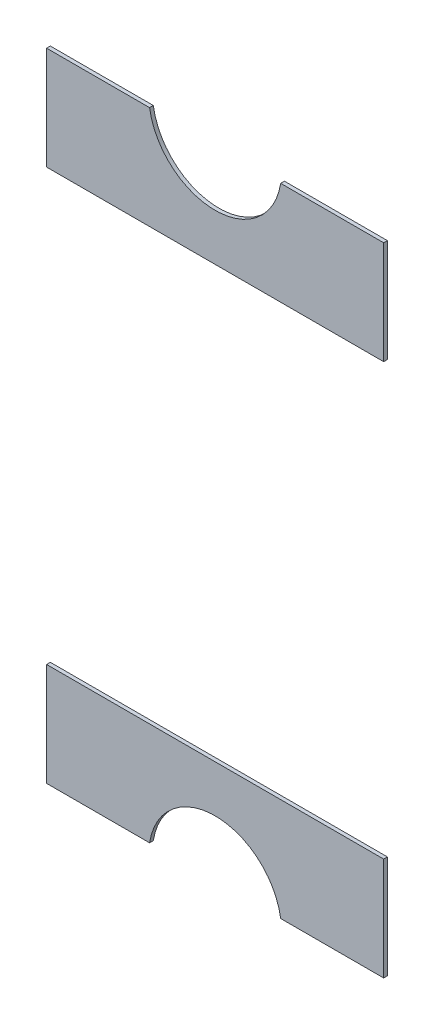
ISO-10303-21;
HEADER;
FILE_DESCRIPTION(('STEP AP214'),'2;1');
FILE_NAME('part.step','',(''),(''),'','','');
FILE_SCHEMA(('AUTOMOTIVE_DESIGN { 1 0 10303 214 1 1 1 1 }'));
ENDSEC;
DATA;
#1=APPLICATION_CONTEXT('core data for automotive mechanical design processes');
#2=APPLICATION_PROTOCOL_DEFINITION('international standard','automotive_design',2000,#1);
#3=PRODUCT_CONTEXT('',#1,'mechanical');
#4=PRODUCT('Part','Part','',(#3));
#5=PRODUCT_RELATED_PRODUCT_CATEGORY('part','',(#4));
#6=PRODUCT_DEFINITION_FORMATION('','',#4);
#7=PRODUCT_DEFINITION_CONTEXT('part definition',#1,'design');
#8=PRODUCT_DEFINITION('design','',#6,#7);
#9=PRODUCT_DEFINITION_SHAPE('','',#8);
#10=(LENGTH_UNIT() NAMED_UNIT(*) SI_UNIT(.MILLI.,.METRE.));
#11=(NAMED_UNIT(*) PLANE_ANGLE_UNIT() SI_UNIT($,.RADIAN.));
#12=(NAMED_UNIT(*) SI_UNIT($,.STERADIAN.) SOLID_ANGLE_UNIT());
#13=UNCERTAINTY_MEASURE_WITH_UNIT(LENGTH_MEASURE(1.E-05),#10,'distance_accuracy_value','');
#14=(GEOMETRIC_REPRESENTATION_CONTEXT(3) GLOBAL_UNCERTAINTY_ASSIGNED_CONTEXT((#13)) GLOBAL_UNIT_ASSIGNED_CONTEXT((#10,
#11,#12)) REPRESENTATION_CONTEXT('',''));
#15=CARTESIAN_POINT('',(0.,0.,0.));
#16=DIRECTION('',(0.,0.,1.));
#17=DIRECTION('',(1.,0.,0.));
#18=AXIS2_PLACEMENT_3D('',#15,#16,#17);
#19=CARTESIAN_POINT('',(-0.45,-0.85,0.309999999776));
#20=DIRECTION('',(0.,0.,1.));
#21=DIRECTION('',(1.,0.,0.));
#22=AXIS2_PLACEMENT_3D('',#19,#20,#21);
#23=PLANE('',#22);
#24=DIRECTION('',(1.,0.,0.));
#25=VECTOR('',#24,1.);
#26=CARTESIAN_POINT('',(0.45,-0.85,0.309999999776));
#27=LINE('',#26,#25);
#28=CARTESIAN_POINT('',(0.45,-0.85,0.309999999776));
#29=VERTEX_POINT('',#28);
#30=CARTESIAN_POINT('',(0.174999999999857,-0.85,0.309999999776));
#31=VERTEX_POINT('',#30);
#32=EDGE_CURVE('P0_E70',#29,#31,#27,.F.);
#33=ORIENTED_EDGE('',*,*,#32,.F.);
#34=DIRECTION('',(0.,1.,0.));
#35=VECTOR('',#34,1.);
#36=CARTESIAN_POINT('',(0.45,-0.575,0.309999999776));
#37=LINE('',#36,#35);
#38=CARTESIAN_POINT('',(0.45,-0.575,0.309999999776));
#39=VERTEX_POINT('',#38);
#40=EDGE_CURVE('P0_E99',#39,#29,#37,.F.);
#41=ORIENTED_EDGE('',*,*,#40,.F.);
#42=DIRECTION('',(1.,0.,0.));
#43=VECTOR('',#42,1.);
#44=CARTESIAN_POINT('',(-0.45,-0.575,0.309999999776));
#45=LINE('',#44,#43);
#46=CARTESIAN_POINT('',(-0.45,-0.575,0.309999999776));
#47=VERTEX_POINT('',#46);
#48=EDGE_CURVE('P0_E111',#47,#39,#45,.T.);
#49=ORIENTED_EDGE('',*,*,#48,.F.);
#50=DIRECTION('',(0.,1.,0.));
#51=VECTOR('',#50,1.);
#52=CARTESIAN_POINT('',(-0.45,-0.85,0.309999999776));
#53=LINE('',#52,#51);
#54=CARTESIAN_POINT('',(-0.45,-0.85,0.309999999776));
#55=VERTEX_POINT('',#54);
#56=EDGE_CURVE('P0_E104',#55,#47,#53,.T.);
#57=ORIENTED_EDGE('',*,*,#56,.F.);
#58=DIRECTION('',(1.,0.,0.));
#59=VECTOR('',#58,1.);
#60=CARTESIAN_POINT('',(-0.175,-0.85,0.309999999776));
#61=LINE('',#60,#59);
#62=CARTESIAN_POINT('',(-0.174999999999718,-0.850000000000022,0.309999999776));
#63=VERTEX_POINT('',#62);
#64=EDGE_CURVE('P0_E73',#63,#55,#61,.F.);
#65=ORIENTED_EDGE('',*,*,#64,.F.);
#66=CARTESIAN_POINT('',(0.,-0.877083333333,0.309999999776));
#67=DIRECTION('',(0.,0.,-1.));
#68=DIRECTION('',(-1.,0.,0.));
#69=AXIS2_PLACEMENT_3D('',#66,#67,#68);
#70=CIRCLE('',#69,0.177083333333);
#71=EDGE_CURVE('P0_E20',#63,#31,#70,.T.);
#72=ORIENTED_EDGE('',*,*,#71,.T.);
#73=EDGE_LOOP('',(#33,#41,#49,#57,#65,#72));
#74=FACE_BOUND('',#73,.T.);
#75=ADVANCED_FACE('P0_F17',(#74),#23,.T.);
#76=CARTESIAN_POINT('',(-0.45,-0.85,0.3));
#77=DIRECTION('',(-1.,0.,0.));
#78=DIRECTION('',(0.,0.,1.));
#79=AXIS2_PLACEMENT_3D('',#76,#77,#78);
#80=PLANE('',#79);
#81=DIRECTION('',(0.,0.,-1.));
#82=VECTOR('',#81,1.);
#83=CARTESIAN_POINT('',(-0.45,-0.85,0.3));
#84=LINE('',#83,#82);
#85=CARTESIAN_POINT('',(-0.45,-0.85,0.3));
#86=VERTEX_POINT('',#85);
#87=EDGE_CURVE('P0_E102',#55,#86,#84,.T.);
#88=ORIENTED_EDGE('',*,*,#87,.F.);
#89=ORIENTED_EDGE('',*,*,#56,.T.);
#90=DIRECTION('',(0.,0.,1.));
#91=VECTOR('',#90,1.);
#92=CARTESIAN_POINT('',(-0.45,-0.575,0.3));
#93=LINE('',#92,#91);
#94=CARTESIAN_POINT('',(-0.45,-0.575,0.3));
#95=VERTEX_POINT('',#94);
#96=EDGE_CURVE('P0_E114',#95,#47,#93,.T.);
#97=ORIENTED_EDGE('',*,*,#96,.F.);
#98=DIRECTION('',(0.,1.,0.));
#99=VECTOR('',#98,1.);
#100=CARTESIAN_POINT('',(-0.45,-0.85,0.3));
#101=LINE('',#100,#99);
#102=EDGE_CURVE('P0_E107',#95,#86,#101,.F.);
#103=ORIENTED_EDGE('',*,*,#102,.T.);
#104=EDGE_LOOP('',(#88,#89,#97,#103));
#105=FACE_BOUND('',#104,.T.);
#106=ADVANCED_FACE('P0_F149',(#105),#80,.T.);
#107=CARTESIAN_POINT('',(-0.175,-0.85,0.3));
#108=DIRECTION('',(0.,-1.,0.));
#109=DIRECTION('',(0.,0.,-1.));
#110=AXIS2_PLACEMENT_3D('',#107,#108,#109);
#111=PLANE('',#110);
#112=DIRECTION('',(0.,0.,-1.));
#113=VECTOR('',#112,1.);
#114=CARTESIAN_POINT('',(-0.174999999999721,-0.850000000000043,0.3));
#115=LINE('',#114,#113);
#116=CARTESIAN_POINT('',(-0.174999999999718,-0.850000000000022,0.3));
#117=VERTEX_POINT('',#116);
#118=EDGE_CURVE('P0_E75',#117,#63,#115,.F.);
#119=ORIENTED_EDGE('',*,*,#118,.T.);
#120=ORIENTED_EDGE('',*,*,#64,.T.);
#121=ORIENTED_EDGE('',*,*,#87,.T.);
#122=DIRECTION('',(1.,0.,0.));
#123=VECTOR('',#122,1.);
#124=CARTESIAN_POINT('',(-0.45,-0.85,0.3));
#125=LINE('',#124,#123);
#126=EDGE_CURVE('P0_E110',#86,#117,#125,.T.);
#127=ORIENTED_EDGE('',*,*,#126,.T.);
#128=EDGE_LOOP('',(#119,#120,#121,#127));
#129=FACE_BOUND('',#128,.T.);
#130=ADVANCED_FACE('P0_F142',(#129),#111,.T.);
#131=CARTESIAN_POINT('',(0.,-0.877083333333,0.3));
#132=DIRECTION('',(0.,0.,-1.));
#133=DIRECTION('',(-1.,0.,0.));
#134=AXIS2_PLACEMENT_3D('',#131,#132,#133);
#135=CYLINDRICAL_SURFACE('',#134,0.177083333333);
#136=CARTESIAN_POINT('',(0.,-0.877083333333,0.3));
#137=DIRECTION('',(0.,0.,-1.));
#138=DIRECTION('',(-1.,0.,0.));
#139=AXIS2_PLACEMENT_3D('',#136,#137,#138);
#140=CIRCLE('',#139,0.177083333333);
#141=CARTESIAN_POINT('',(0.174999999999857,-0.85,0.3));
#142=VERTEX_POINT('',#141);
#143=EDGE_CURVE('P0_E87',#117,#142,#140,.T.);
#144=ORIENTED_EDGE('',*,*,#143,.T.);
#145=DIRECTION('',(0.,0.,-1.));
#146=VECTOR('',#145,1.);
#147=CARTESIAN_POINT('',(0.175,-0.85,0.3));
#148=LINE('',#147,#146);
#149=EDGE_CURVE('P0_E80',#31,#142,#148,.T.);
#150=ORIENTED_EDGE('',*,*,#149,.F.);
#151=ORIENTED_EDGE('',*,*,#71,.F.);
#152=ORIENTED_EDGE('',*,*,#118,.F.);
#153=EDGE_LOOP('',(#144,#150,#151,#152));
#154=FACE_BOUND('',#153,.T.);
#155=ADVANCED_FACE('P0_F85',(#154),#135,.F.);
#156=CARTESIAN_POINT('',(0.45,-0.85,0.3));
#157=DIRECTION('',(0.,-1.,0.));
#158=DIRECTION('',(0.,0.,-1.));
#159=AXIS2_PLACEMENT_3D('',#156,#157,#158);
#160=PLANE('',#159);
#161=DIRECTION('',(0.,0.,-1.));
#162=VECTOR('',#161,1.);
#163=CARTESIAN_POINT('',(0.45,-0.85,0.3));
#164=LINE('',#163,#162);
#165=CARTESIAN_POINT('',(0.45,-0.85,0.3));
#166=VERTEX_POINT('',#165);
#167=EDGE_CURVE('P0_E82',#29,#166,#164,.T.);
#168=ORIENTED_EDGE('',*,*,#167,.F.);
#169=ORIENTED_EDGE('',*,*,#32,.T.);
#170=ORIENTED_EDGE('',*,*,#149,.T.);
#171=DIRECTION('',(1.,0.,0.));
#172=VECTOR('',#171,1.);
#173=CARTESIAN_POINT('',(-0.45,-0.85,0.3));
#174=LINE('',#173,#172);
#175=EDGE_CURVE('P0_E95',#142,#166,#174,.T.);
#176=ORIENTED_EDGE('',*,*,#175,.T.);
#177=EDGE_LOOP('',(#168,#169,#170,#176));
#178=FACE_BOUND('',#177,.T.);
#179=ADVANCED_FACE('P0_F78',(#178),#160,.T.);
#180=CARTESIAN_POINT('',(0.45,-0.575,0.3));
#181=DIRECTION('',(1.,0.,0.));
#182=DIRECTION('',(0.,0.,-1.));
#183=AXIS2_PLACEMENT_3D('',#180,#181,#182);
#184=PLANE('',#183);
#185=DIRECTION('',(0.,0.,1.));
#186=VECTOR('',#185,1.);
#187=CARTESIAN_POINT('',(0.45,-0.575,0.3));
#188=LINE('',#187,#186);
#189=CARTESIAN_POINT('',(0.45,-0.575,0.3));
#190=VERTEX_POINT('',#189);
#191=EDGE_CURVE('P0_E34',#39,#190,#188,.F.);
#192=ORIENTED_EDGE('',*,*,#191,.F.);
#193=ORIENTED_EDGE('',*,*,#40,.T.);
#194=ORIENTED_EDGE('',*,*,#167,.T.);
#195=DIRECTION('',(0.,1.,0.));
#196=VECTOR('',#195,1.);
#197=CARTESIAN_POINT('',(0.45,-0.85,0.3));
#198=LINE('',#197,#196);
#199=EDGE_CURVE('P0_E26',#166,#190,#198,.T.);
#200=ORIENTED_EDGE('',*,*,#199,.T.);
#201=EDGE_LOOP('',(#192,#193,#194,#200));
#202=FACE_BOUND('',#201,.T.);
#203=ADVANCED_FACE('P0_F153',(#202),#184,.T.);
#204=CARTESIAN_POINT('',(-0.45,-0.575,0.3));
#205=DIRECTION('',(0.,1.,0.));
#206=DIRECTION('',(0.,0.,1.));
#207=AXIS2_PLACEMENT_3D('',#204,#205,#206);
#208=PLANE('',#207);
#209=ORIENTED_EDGE('',*,*,#96,.T.);
#210=ORIENTED_EDGE('',*,*,#48,.T.);
#211=ORIENTED_EDGE('',*,*,#191,.T.);
#212=DIRECTION('',(1.,0.,0.));
#213=VECTOR('',#212,1.);
#214=CARTESIAN_POINT('',(-0.45,-0.575,0.3));
#215=LINE('',#214,#213);
#216=EDGE_CURVE('P0_E11',#190,#95,#215,.F.);
#217=ORIENTED_EDGE('',*,*,#216,.T.);
#218=EDGE_LOOP('',(#209,#210,#211,#217));
#219=FACE_BOUND('',#218,.T.);
#220=ADVANCED_FACE('P0_F151',(#219),#208,.T.);
#221=CARTESIAN_POINT('',(-0.45,-0.85,0.3));
#222=DIRECTION('',(0.,0.,1.));
#223=DIRECTION('',(1.,0.,0.));
#224=AXIS2_PLACEMENT_3D('',#221,#222,#223);
#225=PLANE('',#224);
#226=ORIENTED_EDGE('',*,*,#199,.F.);
#227=ORIENTED_EDGE('',*,*,#175,.F.);
#228=ORIENTED_EDGE('',*,*,#143,.F.);
#229=ORIENTED_EDGE('',*,*,#126,.F.);
#230=ORIENTED_EDGE('',*,*,#102,.F.);
#231=ORIENTED_EDGE('',*,*,#216,.F.);
#232=EDGE_LOOP('',(#226,#227,#228,#229,#230,#231));
#233=FACE_BOUND('',#232,.T.);
#234=ADVANCED_FACE('P0_F146',(#233),#225,.F.);
#235=CLOSED_SHELL('',(#75,#106,#130,#155,#179,#203,#220,#234));
#236=MANIFOLD_SOLID_BREP('P0_B1',#235);
#237=CARTESIAN_POINT('',(-0.175,0.85,0.3));
#238=DIRECTION('',(0.,0.,-1.));
#239=DIRECTION('',(-1.,0.,0.));
#240=AXIS2_PLACEMENT_3D('',#237,#238,#239);
#241=PLANE('',#240);
#242=DIRECTION('',(0.,1.,0.));
#243=VECTOR('',#242,1.);
#244=CARTESIAN_POINT('',(0.45,0.575,0.3));
#245=LINE('',#244,#243);
#246=CARTESIAN_POINT('',(0.45,0.85,0.3));
#247=VERTEX_POINT('',#246);
#248=CARTESIAN_POINT('',(0.45,0.575,0.3));
#249=VERTEX_POINT('',#248);
#250=EDGE_CURVE('P1_E88',#247,#249,#245,.F.);
#251=ORIENTED_EDGE('',*,*,#250,.T.);
#252=DIRECTION('',(1.,0.,0.));
#253=VECTOR('',#252,1.);
#254=CARTESIAN_POINT('',(-0.45,0.575,0.3));
#255=LINE('',#254,#253);
#256=CARTESIAN_POINT('',(-0.45,0.575,0.3));
#257=VERTEX_POINT('',#256);
#258=EDGE_CURVE('P1_E102',#249,#257,#255,.F.);
#259=ORIENTED_EDGE('',*,*,#258,.T.);
#260=DIRECTION('',(0.,1.,0.));
#261=VECTOR('',#260,1.);
#262=CARTESIAN_POINT('',(-0.45,0.85,0.3));
#263=LINE('',#262,#261);
#264=CARTESIAN_POINT('',(-0.45,0.85,0.3));
#265=VERTEX_POINT('',#264);
#266=EDGE_CURVE('P1_E109',#257,#265,#263,.T.);
#267=ORIENTED_EDGE('',*,*,#266,.T.);
#268=DIRECTION('',(1.,0.,0.));
#269=VECTOR('',#268,1.);
#270=CARTESIAN_POINT('',(-0.175,0.85,0.3));
#271=LINE('',#270,#269);
#272=CARTESIAN_POINT('',(-0.174999999999718,0.850000000000022,0.3));
#273=VERTEX_POINT('',#272);
#274=EDGE_CURVE('P1_E66',#265,#273,#271,.T.);
#275=ORIENTED_EDGE('',*,*,#274,.T.);
#276=CARTESIAN_POINT('',(0.,0.877083333333,0.3));
#277=DIRECTION('',(0.,0.,-1.));
#278=DIRECTION('',(-1.,0.,0.));
#279=AXIS2_PLACEMENT_3D('',#276,#277,#278);
#280=CIRCLE('',#279,0.177083333333);
#281=CARTESIAN_POINT('',(0.174999999999857,0.85,0.3));
#282=VERTEX_POINT('',#281);
#283=EDGE_CURVE('P1_E20',#273,#282,#280,.F.);
#284=ORIENTED_EDGE('',*,*,#283,.T.);
#285=DIRECTION('',(1.,0.,0.));
#286=VECTOR('',#285,1.);
#287=CARTESIAN_POINT('',(0.45,0.85,0.3));
#288=LINE('',#287,#286);
#289=EDGE_CURVE('P1_E72',#282,#247,#288,.T.);
#290=ORIENTED_EDGE('',*,*,#289,.T.);
#291=EDGE_LOOP('',(#251,#259,#267,#275,#284,#290));
#292=FACE_BOUND('',#291,.T.);
#293=ADVANCED_FACE('P1_F17',(#292),#241,.T.);
#294=CARTESIAN_POINT('',(-0.175,0.85,0.3));
#295=DIRECTION('',(0.,-1.,0.));
#296=DIRECTION('',(0.,0.,-1.));
#297=AXIS2_PLACEMENT_3D('',#294,#295,#296);
#298=PLANE('',#297);
#299=DIRECTION('',(-1.,0.,0.));
#300=VECTOR('',#299,1.);
#301=CARTESIAN_POINT('',(-0.175,0.85,0.309999999776));
#302=LINE('',#301,#300);
#303=CARTESIAN_POINT('',(-0.45,0.85,0.309999999776));
#304=VERTEX_POINT('',#303);
#305=CARTESIAN_POINT('',(-0.174999999999718,0.850000000000022,0.309999999776));
#306=VERTEX_POINT('',#305);
#307=EDGE_CURVE('P1_E126',#304,#306,#302,.F.);
#308=ORIENTED_EDGE('',*,*,#307,.T.);
#309=DIRECTION('',(0.,0.,-1.));
#310=VECTOR('',#309,1.);
#311=CARTESIAN_POINT('',(-0.174999999999721,0.850000000000043,0.3));
#312=LINE('',#311,#310);
#313=EDGE_CURVE('P1_E83',#306,#273,#312,.T.);
#314=ORIENTED_EDGE('',*,*,#313,.T.);
#315=ORIENTED_EDGE('',*,*,#274,.F.);
#316=DIRECTION('',(0.,0.,-1.));
#317=VECTOR('',#316,1.);
#318=CARTESIAN_POINT('',(-0.45,0.85,0.3));
#319=LINE('',#318,#317);
#320=EDGE_CURVE('P1_E106',#265,#304,#319,.F.);
#321=ORIENTED_EDGE('',*,*,#320,.T.);
#322=EDGE_LOOP('',(#308,#314,#315,#321));
#323=FACE_BOUND('',#322,.T.);
#324=ADVANCED_FACE('P1_F153',(#323),#298,.F.);
#325=CARTESIAN_POINT('',(0.,0.877083333333,0.3));
#326=DIRECTION('',(0.,0.,-1.));
#327=DIRECTION('',(-1.,0.,0.));
#328=AXIS2_PLACEMENT_3D('',#325,#326,#327);
#329=CYLINDRICAL_SURFACE('',#328,0.177083333333);
#330=ORIENTED_EDGE('',*,*,#283,.F.);
#331=ORIENTED_EDGE('',*,*,#313,.F.);
#332=CARTESIAN_POINT('',(0.,0.877083333333,0.309999999776));
#333=DIRECTION('',(0.,0.,-1.));
#334=DIRECTION('',(-1.,0.,0.));
#335=AXIS2_PLACEMENT_3D('',#332,#333,#334);
#336=CIRCLE('',#335,0.177083333333);
#337=CARTESIAN_POINT('',(0.174999999999857,0.85,0.309999999776));
#338=VERTEX_POINT('',#337);
#339=EDGE_CURVE('P1_E87',#306,#338,#336,.F.);
#340=ORIENTED_EDGE('',*,*,#339,.T.);
#341=DIRECTION('',(0.,0.,-1.));
#342=VECTOR('',#341,1.);
#343=CARTESIAN_POINT('',(0.175,0.85,0.3));
#344=LINE('',#343,#342);
#345=EDGE_CURVE('P1_E76',#338,#282,#344,.T.);
#346=ORIENTED_EDGE('',*,*,#345,.T.);
#347=EDGE_LOOP('',(#330,#331,#340,#346));
#348=FACE_BOUND('',#347,.T.);
#349=ADVANCED_FACE('P1_F85',(#348),#329,.F.);
#350=CARTESIAN_POINT('',(0.45,0.85,0.3));
#351=DIRECTION('',(0.,-1.,0.));
#352=DIRECTION('',(0.,0.,-1.));
#353=AXIS2_PLACEMENT_3D('',#350,#351,#352);
#354=PLANE('',#353);
#355=DIRECTION('',(-1.,0.,0.));
#356=VECTOR('',#355,1.);
#357=CARTESIAN_POINT('',(-0.175,0.85,0.309999999776));
#358=LINE('',#357,#356);
#359=CARTESIAN_POINT('',(0.45,0.85,0.309999999776));
#360=VERTEX_POINT('',#359);
#361=EDGE_CURVE('P1_E98',#338,#360,#358,.F.);
#362=ORIENTED_EDGE('',*,*,#361,.T.);
#363=DIRECTION('',(0.,0.,1.));
#364=VECTOR('',#363,1.);
#365=CARTESIAN_POINT('',(0.45,0.85,0.3));
#366=LINE('',#365,#364);
#367=EDGE_CURVE('P1_E78',#360,#247,#366,.F.);
#368=ORIENTED_EDGE('',*,*,#367,.T.);
#369=ORIENTED_EDGE('',*,*,#289,.F.);
#370=ORIENTED_EDGE('',*,*,#345,.F.);
#371=EDGE_LOOP('',(#362,#368,#369,#370));
#372=FACE_BOUND('',#371,.T.);
#373=ADVANCED_FACE('P1_F74',(#372),#354,.F.);
#374=CARTESIAN_POINT('',(0.45,0.575,0.3));
#375=DIRECTION('',(-1.,0.,0.));
#376=DIRECTION('',(0.,0.,1.));
#377=AXIS2_PLACEMENT_3D('',#374,#375,#376);
#378=PLANE('',#377);
#379=DIRECTION('',(0.,1.,0.));
#380=VECTOR('',#379,1.);
#381=CARTESIAN_POINT('',(0.45,0.85,0.309999999776));
#382=LINE('',#381,#380);
#383=CARTESIAN_POINT('',(0.45,0.575,0.309999999776));
#384=VERTEX_POINT('',#383);
#385=EDGE_CURVE('P1_E95',#360,#384,#382,.F.);
#386=ORIENTED_EDGE('',*,*,#385,.T.);
#387=DIRECTION('',(0.,0.,1.));
#388=VECTOR('',#387,1.);
#389=CARTESIAN_POINT('',(0.45,0.575,0.3));
#390=LINE('',#389,#388);
#391=EDGE_CURVE('P1_E118',#384,#249,#390,.F.);
#392=ORIENTED_EDGE('',*,*,#391,.T.);
#393=ORIENTED_EDGE('',*,*,#250,.F.);
#394=ORIENTED_EDGE('',*,*,#367,.F.);
#395=EDGE_LOOP('',(#386,#392,#393,#394));
#396=FACE_BOUND('',#395,.T.);
#397=ADVANCED_FACE('P1_F150',(#396),#378,.F.);
#398=CARTESIAN_POINT('',(-0.45,0.575,0.3));
#399=DIRECTION('',(0.,1.,0.));
#400=DIRECTION('',(0.,0.,1.));
#401=AXIS2_PLACEMENT_3D('',#398,#399,#400);
#402=PLANE('',#401);
#403=DIRECTION('',(-1.,0.,0.));
#404=VECTOR('',#403,1.);
#405=CARTESIAN_POINT('',(-0.175,0.575,0.309999999776));
#406=LINE('',#405,#404);
#407=CARTESIAN_POINT('',(-0.45,0.575,0.309999999776));
#408=VERTEX_POINT('',#407);
#409=EDGE_CURVE('P1_E26',#384,#408,#406,.T.);
#410=ORIENTED_EDGE('',*,*,#409,.T.);
#411=DIRECTION('',(0.,0.,-1.));
#412=VECTOR('',#411,1.);
#413=CARTESIAN_POINT('',(-0.45,0.575,0.3));
#414=LINE('',#413,#412);
#415=EDGE_CURVE('P1_E34',#408,#257,#414,.T.);
#416=ORIENTED_EDGE('',*,*,#415,.T.);
#417=ORIENTED_EDGE('',*,*,#258,.F.);
#418=ORIENTED_EDGE('',*,*,#391,.F.);
#419=EDGE_LOOP('',(#410,#416,#417,#418));
#420=FACE_BOUND('',#419,.T.);
#421=ADVANCED_FACE('P1_F145',(#420),#402,.F.);
#422=CARTESIAN_POINT('',(-0.45,0.85,0.3));
#423=DIRECTION('',(1.,0.,0.));
#424=DIRECTION('',(0.,0.,-1.));
#425=AXIS2_PLACEMENT_3D('',#422,#423,#424);
#426=PLANE('',#425);
#427=DIRECTION('',(0.,1.,0.));
#428=VECTOR('',#427,1.);
#429=CARTESIAN_POINT('',(-0.45,0.85,0.309999999776));
#430=LINE('',#429,#428);
#431=EDGE_CURVE('P1_E11',#408,#304,#430,.T.);
#432=ORIENTED_EDGE('',*,*,#431,.T.);
#433=ORIENTED_EDGE('',*,*,#320,.F.);
#434=ORIENTED_EDGE('',*,*,#266,.F.);
#435=ORIENTED_EDGE('',*,*,#415,.F.);
#436=EDGE_LOOP('',(#432,#433,#434,#435));
#437=FACE_BOUND('',#436,.T.);
#438=ADVANCED_FACE('P1_F152',(#437),#426,.F.);
#439=CARTESIAN_POINT('',(-0.175,0.85,0.309999999776));
#440=DIRECTION('',(0.,0.,-1.));
#441=DIRECTION('',(-1.,0.,0.));
#442=AXIS2_PLACEMENT_3D('',#439,#440,#441);
#443=PLANE('',#442);
#444=ORIENTED_EDGE('',*,*,#409,.F.);
#445=ORIENTED_EDGE('',*,*,#385,.F.);
#446=ORIENTED_EDGE('',*,*,#361,.F.);
#447=ORIENTED_EDGE('',*,*,#339,.F.);
#448=ORIENTED_EDGE('',*,*,#307,.F.);
#449=ORIENTED_EDGE('',*,*,#431,.F.);
#450=EDGE_LOOP('',(#444,#445,#446,#447,#448,#449));
#451=FACE_BOUND('',#450,.T.);
#452=ADVANCED_FACE('P1_F148',(#451),#443,.F.);
#453=CLOSED_SHELL('',(#293,#324,#349,#373,#397,#421,#438,#452));
#454=MANIFOLD_SOLID_BREP('P1_B1',#453);
#455=ADVANCED_BREP_SHAPE_REPRESENTATION('',(#18,#236,#454),#14);
#456=SHAPE_DEFINITION_REPRESENTATION(#9,#455);
ENDSEC;
END-ISO-10303-21;
